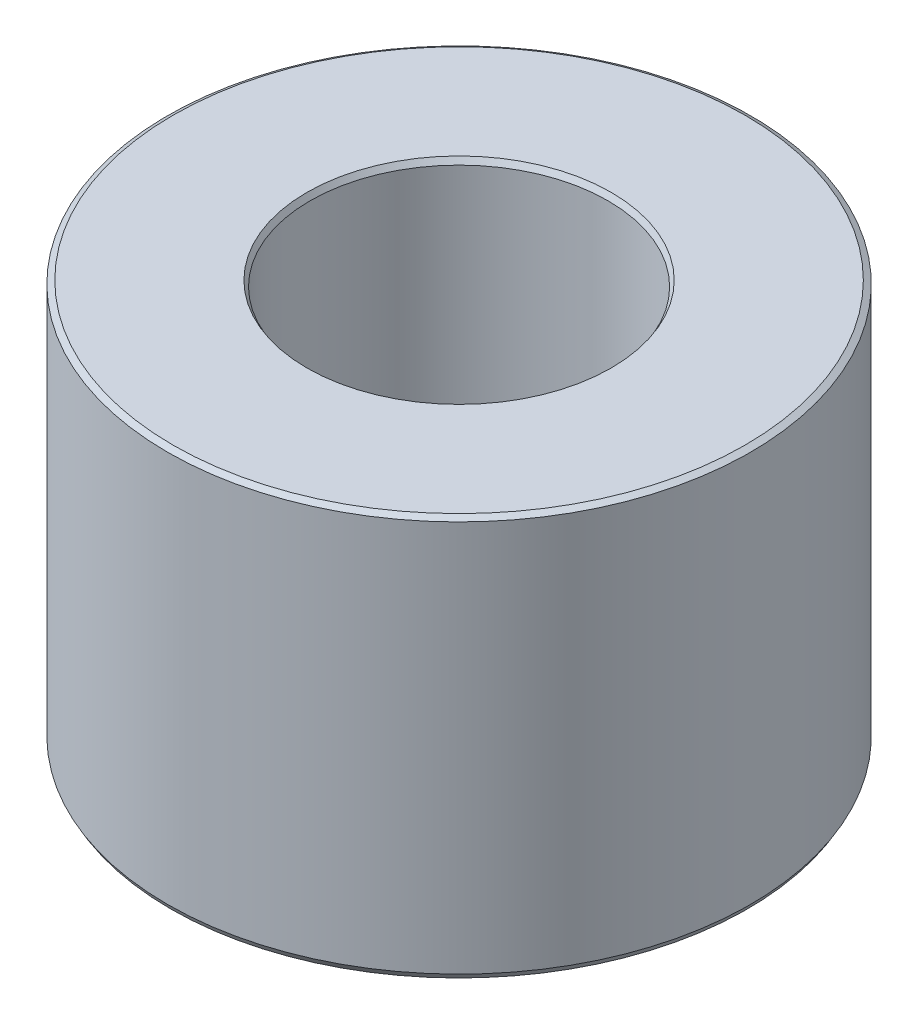
ISO-10303-21;
HEADER;
FILE_DESCRIPTION(('STEP AP214'),'2;1');
FILE_NAME('part.step','',(''),(''),'','','');
FILE_SCHEMA(('AUTOMOTIVE_DESIGN { 1 0 10303 214 1 1 1 1 }'));
ENDSEC;
DATA;
#1=APPLICATION_CONTEXT('core data for automotive mechanical design processes');
#2=APPLICATION_PROTOCOL_DEFINITION('international standard','automotive_design',2000,#1);
#3=PRODUCT_CONTEXT('',#1,'mechanical');
#4=PRODUCT('Part','Part','',(#3));
#5=PRODUCT_RELATED_PRODUCT_CATEGORY('part','',(#4));
#6=PRODUCT_DEFINITION_FORMATION('','',#4);
#7=PRODUCT_DEFINITION_CONTEXT('part definition',#1,'design');
#8=PRODUCT_DEFINITION('design','',#6,#7);
#9=PRODUCT_DEFINITION_SHAPE('','',#8);
#10=(LENGTH_UNIT() NAMED_UNIT(*) SI_UNIT(.MILLI.,.METRE.));
#11=(NAMED_UNIT(*) PLANE_ANGLE_UNIT() SI_UNIT($,.RADIAN.));
#12=(NAMED_UNIT(*) SI_UNIT($,.STERADIAN.) SOLID_ANGLE_UNIT());
#13=UNCERTAINTY_MEASURE_WITH_UNIT(LENGTH_MEASURE(1.E-05),#10,'distance_accuracy_value','');
#14=(GEOMETRIC_REPRESENTATION_CONTEXT(3) GLOBAL_UNCERTAINTY_ASSIGNED_CONTEXT((#13)) GLOBAL_UNIT_ASSIGNED_CONTEXT((#10,
#11,#12)) REPRESENTATION_CONTEXT('',''));
#15=CARTESIAN_POINT('',(0.,0.,0.));
#16=DIRECTION('',(0.,0.,1.));
#17=DIRECTION('',(1.,0.,0.));
#18=AXIS2_PLACEMENT_3D('',#15,#16,#17);
#19=CARTESIAN_POINT('',(0.,65.2626744363393,0.));
#20=DIRECTION('',(0.,-1.,0.));
#21=DIRECTION('',(0.,0.,-1.));
#22=AXIS2_PLACEMENT_3D('',#19,#20,#21);
#23=CYLINDRICAL_SURFACE('',#22,47.5);
#24=CARTESIAN_POINT('',(0.,0.916827320530972,0.));
#25=DIRECTION('',(0.,1.,0.));
#26=DIRECTION('',(0.,0.,1.));
#27=AXIS2_PLACEMENT_3D('',#24,#25,#26);
#28=CIRCLE('',#27,47.5);
#29=CARTESIAN_POINT('',(0.,0.916827320530972,47.5));
#30=VERTEX_POINT('',#29);
#31=EDGE_CURVE('E10',#30,#30,#28,.T.);
#32=ORIENTED_EDGE('',*,*,#31,.T.);
#33=EDGE_LOOP('',(#32));
#34=FACE_BOUND('',#33,.T.);
#35=CARTESIAN_POINT('',(0.,64.7333439360303,0.));
#36=DIRECTION('',(0.,1.,0.));
#37=DIRECTION('',(0.,0.,1.));
#38=AXIS2_PLACEMENT_3D('',#35,#36,#37);
#39=CIRCLE('',#38,47.5);
#40=CARTESIAN_POINT('',(0.,64.7333439360303,47.5));
#41=VERTEX_POINT('',#40);
#42=EDGE_CURVE('E50',#41,#41,#39,.F.);
#43=ORIENTED_EDGE('',*,*,#42,.T.);
#44=EDGE_LOOP('',(#43));
#45=FACE_BOUND('',#44,.T.);
#46=ADVANCED_FACE('F39',(#34,#45),#23,.T.);
#47=CARTESIAN_POINT('',(0.,65.2626744363393,0.));
#48=DIRECTION('',(0.,1.,0.));
#49=DIRECTION('',(0.,0.,1.));
#50=AXIS2_PLACEMENT_3D('',#47,#48,#49);
#51=PLANE('',#50);
#52=CARTESIAN_POINT('',(0.,65.2626744363393,0.));
#53=DIRECTION('',(0.,1.,0.));
#54=DIRECTION('',(0.,0.,1.));
#55=AXIS2_PLACEMENT_3D('',#52,#53,#54);
#56=CIRCLE('',#55,24.792961840033);
#57=CARTESIAN_POINT('',(0.,65.2626744363393,24.792961840033));
#58=VERTEX_POINT('',#57);
#59=EDGE_CURVE('E58',#58,#58,#56,.F.);
#60=ORIENTED_EDGE('',*,*,#59,.T.);
#61=EDGE_LOOP('',(#60));
#62=FACE_BOUND('',#61,.T.);
#63=CARTESIAN_POINT('',(0.,65.2626744363393,0.));
#64=DIRECTION('',(0.,1.,0.));
#65=DIRECTION('',(0.,0.,1.));
#66=AXIS2_PLACEMENT_3D('',#63,#64,#65);
#67=CIRCLE('',#66,46.583172679469);
#68=CARTESIAN_POINT('',(0.,65.2626744363393,46.583172679469));
#69=VERTEX_POINT('',#68);
#70=EDGE_CURVE('E61',#69,#69,#67,.T.);
#71=ORIENTED_EDGE('',*,*,#70,.T.);
#72=EDGE_LOOP('',(#71));
#73=FACE_BOUND('',#72,.T.);
#74=ADVANCED_FACE('F88',(#62,#73),#51,.T.);
#75=CARTESIAN_POINT('',(0.,0.,0.));
#76=DIRECTION('',(0.,1.,0.));
#77=DIRECTION('',(0.,0.,1.));
#78=AXIS2_PLACEMENT_3D('',#75,#76,#77);
#79=PLANE('',#78);
#80=CARTESIAN_POINT('',(0.,0.,0.));
#81=DIRECTION('',(0.,1.,0.));
#82=DIRECTION('',(0.,0.,1.));
#83=AXIS2_PLACEMENT_3D('',#80,#81,#82);
#84=CIRCLE('',#83,25.1804586602549);
#85=CARTESIAN_POINT('',(0.,0.,25.1804586602549));
#86=VERTEX_POINT('',#85);
#87=EDGE_CURVE('E51',#86,#86,#84,.T.);
#88=ORIENTED_EDGE('',*,*,#87,.T.);
#89=EDGE_LOOP('',(#88));
#90=FACE_BOUND('',#89,.T.);
#91=CARTESIAN_POINT('',(0.,0.,0.));
#92=DIRECTION('',(0.,1.,0.));
#93=DIRECTION('',(0.,0.,1.));
#94=AXIS2_PLACEMENT_3D('',#91,#92,#93);
#95=CIRCLE('',#94,46.970669499691);
#96=CARTESIAN_POINT('',(0.,0.,46.970669499691));
#97=VERTEX_POINT('',#96);
#98=EDGE_CURVE('E54',#97,#97,#95,.F.);
#99=ORIENTED_EDGE('',*,*,#98,.T.);
#100=EDGE_LOOP('',(#99));
#101=FACE_BOUND('',#100,.T.);
#102=ADVANCED_FACE('F83',(#90,#101),#79,.F.);
#103=CARTESIAN_POINT('',(0.,65.2626744363393,0.));
#104=DIRECTION('',(0.,-1.,0.));
#105=DIRECTION('',(0.,0.,-1.));
#106=AXIS2_PLACEMENT_3D('',#103,#104,#105);
#107=CYLINDRICAL_SURFACE('',#106,24.263631339724);
#108=CARTESIAN_POINT('',(0.,64.3458471158083,0.));
#109=DIRECTION('',(0.,1.,0.));
#110=DIRECTION('',(0.,0.,1.));
#111=AXIS2_PLACEMENT_3D('',#108,#109,#110);
#112=CIRCLE('',#111,24.263631339724);
#113=CARTESIAN_POINT('',(0.,64.3458471158083,24.263631339724));
#114=VERTEX_POINT('',#113);
#115=EDGE_CURVE('E67',#114,#114,#112,.T.);
#116=ORIENTED_EDGE('',*,*,#115,.T.);
#117=EDGE_LOOP('',(#116));
#118=FACE_BOUND('',#117,.T.);
#119=CARTESIAN_POINT('',(0.,0.529330500308955,0.));
#120=DIRECTION('',(0.,1.,0.));
#121=DIRECTION('',(0.,0.,1.));
#122=AXIS2_PLACEMENT_3D('',#119,#120,#121);
#123=CIRCLE('',#122,24.263631339724);
#124=CARTESIAN_POINT('',(0.,0.529330500308955,24.263631339724));
#125=VERTEX_POINT('',#124);
#126=EDGE_CURVE('E69',#125,#125,#123,.F.);
#127=ORIENTED_EDGE('',*,*,#126,.T.);
#128=EDGE_LOOP('',(#127));
#129=FACE_BOUND('',#128,.T.);
#130=ADVANCED_FACE('F71',(#118,#129),#107,.F.);
#131=CARTESIAN_POINT('',(0.,64.3458471158083,0.));
#132=DIRECTION('',(0.,1.,0.));
#133=DIRECTION('',(0.,0.,1.));
#134=AXIS2_PLACEMENT_3D('',#131,#132,#133);
#135=CONICAL_SURFACE('',#134,24.263631339724,0.523598775598302);
#136=CARTESIAN_POINT('',(0.,65.2626744363393,24.792961840033));
#137=CARTESIAN_POINT('',(0.,65.2531241517504,24.7874479806547));
#138=CARTESIAN_POINT('',(0.,65.2435738671615,24.7819341212765));
#139=CARTESIAN_POINT('',(0.,65.2244732979838,24.7709064025201));
#140=CARTESIAN_POINT('',(0.,65.2149230133949,24.7653925431419));
#141=CARTESIAN_POINT('',(0.,65.1958224442172,24.7543648243854));
#142=CARTESIAN_POINT('',(0.,65.1862721596283,24.7488509650072));
#143=CARTESIAN_POINT('',(0.,65.1671715904506,24.7378232462508));
#144=CARTESIAN_POINT('',(0.,65.1576213058617,24.7323093868726));
#145=CARTESIAN_POINT('',(0.,65.138520736684,24.7212816681161));
#146=CARTESIAN_POINT('',(0.,65.1289704520951,24.7157678087379));
#147=CARTESIAN_POINT('',(0.,65.1098698829174,24.7047400899815));
#148=CARTESIAN_POINT('',(0.,65.1003195983286,24.6992262306032));
#149=CARTESIAN_POINT('',(0.,65.0812190291508,24.6881985118468));
#150=CARTESIAN_POINT('',(0.,65.071668744562,24.6826846524686));
#151=CARTESIAN_POINT('',(0.,65.0525681753842,24.6716569337121));
#152=CARTESIAN_POINT('',(0.,65.0430178907954,24.6661430743339));
#153=CARTESIAN_POINT('',(0.,65.0239173216176,24.6551153555775));
#154=CARTESIAN_POINT('',(0.,65.0143670370288,24.6496014961993));
#155=CARTESIAN_POINT('',(0.,64.995266467851,24.6385737774428));
#156=CARTESIAN_POINT('',(0.,64.9857161832622,24.6330599180646));
#157=CARTESIAN_POINT('',(0.,64.9666156140845,24.6220321993082));
#158=CARTESIAN_POINT('',(0.,64.9570653294956,24.61651833993));
#159=CARTESIAN_POINT('',(0.,64.9379647603179,24.6054906211735));
#160=CARTESIAN_POINT('',(0.,64.928414475729,24.5999767617953));
#161=CARTESIAN_POINT('',(0.,64.9093139065513,24.5889490430389));
#162=CARTESIAN_POINT('',(0.,64.8997636219624,24.5834351836607));
#163=CARTESIAN_POINT('',(0.,64.8806630527847,24.5724074649042));
#164=CARTESIAN_POINT('',(0.,64.8711127681958,24.566893605526));
#165=CARTESIAN_POINT('',(0.,64.8520121990181,24.5558658867696));
#166=CARTESIAN_POINT('',(0.,64.8424619144292,24.5503520273913));
#167=CARTESIAN_POINT('',(0.,64.8233613452515,24.5393243086349));
#168=CARTESIAN_POINT('',(0.,64.8138110606626,24.5338104492567));
#169=CARTESIAN_POINT('',(0.,64.7947104914849,24.5227827305002));
#170=CARTESIAN_POINT('',(0.,64.785160206896,24.517268871122));
#171=CARTESIAN_POINT('',(0.,64.7660596377183,24.5062411523656));
#172=CARTESIAN_POINT('',(0.,64.7565093531294,24.5007272929874));
#173=CARTESIAN_POINT('',(0.,64.7374087839517,24.4896995742309));
#174=CARTESIAN_POINT('',(0.,64.7278584993628,24.4841857148527));
#175=CARTESIAN_POINT('',(0.,64.7087579301851,24.4731579960963));
#176=CARTESIAN_POINT('',(0.,64.6992076455962,24.4676441367181));
#177=CARTESIAN_POINT('',(0.,64.6801070764185,24.4566164179616));
#178=CARTESIAN_POINT('',(0.,64.6705567918297,24.4511025585834));
#179=CARTESIAN_POINT('',(0.,64.6514562226519,24.440074839827));
#180=CARTESIAN_POINT('',(0.,64.6419059380631,24.4345609804488));
#181=CARTESIAN_POINT('',(0.,64.6228053688853,24.4235332616923));
#182=CARTESIAN_POINT('',(0.,64.6132550842965,24.4180194023141));
#183=CARTESIAN_POINT('',(0.,64.5941545151187,24.4069916835577));
#184=CARTESIAN_POINT('',(0.,64.5846042305299,24.4014778241794));
#185=CARTESIAN_POINT('',(0.,64.5655036613521,24.390450105423));
#186=CARTESIAN_POINT('',(0.,64.5559533767633,24.3849362460448));
#187=CARTESIAN_POINT('',(0.,64.5368528075855,24.3739085272883));
#188=CARTESIAN_POINT('',(0.,64.5273025229967,24.3683946679101));
#189=CARTESIAN_POINT('',(0.,64.508201953819,24.3573669491537));
#190=CARTESIAN_POINT('',(0.,64.4986516692301,24.3518530897755));
#191=CARTESIAN_POINT('',(0.,64.4795511000524,24.340825371019));
#192=CARTESIAN_POINT('',(0.,64.4700008154635,24.3353115116408));
#193=CARTESIAN_POINT('',(0.,64.4509002462858,24.3242837928844));
#194=CARTESIAN_POINT('',(0.,64.4413499616969,24.3187699335062));
#195=CARTESIAN_POINT('',(0.,64.4222493925192,24.3077422147497));
#196=CARTESIAN_POINT('',(0.,64.4126991079303,24.3022283553715));
#197=CARTESIAN_POINT('',(0.,64.3935985387526,24.2912006366151));
#198=CARTESIAN_POINT('',(0.,64.3840482541637,24.2856867772369));
#199=CARTESIAN_POINT('',(0.,64.364947684986,24.2746590584804));
#200=CARTESIAN_POINT('',(0.,64.3553974003971,24.2691451991022));
#201=CARTESIAN_POINT('',(0.,64.3458471158083,24.263631339724));
#202=B_SPLINE_CURVE_WITH_KNOTS('',3,(#136,#137,#138,#139,#140,#141,#142,#143,#144,#145,#146,
#147,#148,#149,#150,#151,#152,#153,#154,#155,#156,#157,#158,#159,#160,#161,#162,#163,#164,#165,
#166,#167,#168,#169,#170,#171,#172,#173,#174,#175,#176,#177,#178,#179,#180,#181,#182,#183,#184,
#185,#186,#187,#188,#189,#190,#191,#192,#193,#194,#195,#196,#197,#198,#199,#200,#201),
.UNSPECIFIED.,.F.,.F.,(4,2,2,2,2,2,2,2,2,2,2,2,2,2,2,2,2,2,2,2,2,2,2,2,2,2,2,2,2,2,2,2,4),(0.,
0.0330831562693085,0.0661663125386171,0.0992494688079239,0.132332625077244,0.165415781346553,
0.19849893761586,0.231582093885168,0.264665250154489,0.297748406423797,0.330831562693104,
0.363914718962413,0.396997875231733,0.43008103150104,0.463164187770349,0.496247344039657,
0.529330500308978,0.562413656578284,0.595496812847593,0.628579969116902,0.661663125386222,
0.694746281655529,0.727829437924837,0.760912594194146,0.793995750463465,0.827078906732773,
0.860162063002082,0.89324521927139,0.926328375540709,0.959411531810018,0.992494688079326,
1.02557784434863,1.05866100061794),.UNSPECIFIED.);
#203=EDGE_CURVE('BSEAM77',#58,#114,#202,.T.);
#204=ORIENTED_EDGE('',*,*,#59,.F.);
#205=ORIENTED_EDGE('',*,*,#115,.F.);
#206=ORIENTED_EDGE('',*,*,#203,.T.);
#207=ORIENTED_EDGE('',*,*,#203,.F.);
#208=EDGE_LOOP('',(#204,#206,#205,#207));
#209=FACE_BOUND('',#208,.T.);
#210=ADVANCED_FACE('F77',(#209),#135,.F.);
#211=CARTESIAN_POINT('',(0.,0.,0.));
#212=DIRECTION('',(0.,-1.,0.));
#213=DIRECTION('',(0.,0.,-1.));
#214=AXIS2_PLACEMENT_3D('',#211,#212,#213);
#215=CONICAL_SURFACE('',#214,25.1804586602549,1.04719755119659);
#216=ORIENTED_EDGE('',*,*,#126,.F.);
#217=EDGE_LOOP('',(#216));
#218=FACE_BOUND('',#217,.T.);
#219=ORIENTED_EDGE('',*,*,#87,.F.);
#220=EDGE_LOOP('',(#219));
#221=FACE_BOUND('',#220,.T.);
#222=ADVANCED_FACE('F73',(#218,#221),#215,.F.);
#223=CARTESIAN_POINT('',(0.,0.916827320530972,0.));
#224=DIRECTION('',(0.,1.,0.));
#225=DIRECTION('',(0.,0.,1.));
#226=AXIS2_PLACEMENT_3D('',#223,#224,#225);
#227=CONICAL_SURFACE('',#226,47.5,0.523598775598307);
#228=ORIENTED_EDGE('',*,*,#98,.F.);
#229=EDGE_LOOP('',(#228));
#230=FACE_BOUND('',#229,.T.);
#231=ORIENTED_EDGE('',*,*,#31,.F.);
#232=EDGE_LOOP('',(#231));
#233=FACE_BOUND('',#232,.T.);
#234=ADVANCED_FACE('F76',(#230,#233),#227,.T.);
#235=CARTESIAN_POINT('',(0.,65.2626744363393,0.));
#236=DIRECTION('',(0.,-1.,0.));
#237=DIRECTION('',(0.,0.,-1.));
#238=AXIS2_PLACEMENT_3D('',#235,#236,#237);
#239=CONICAL_SURFACE('',#238,46.583172679469,1.0471975511966);
#240=ORIENTED_EDGE('',*,*,#42,.F.);
#241=EDGE_LOOP('',(#240));
#242=FACE_BOUND('',#241,.T.);
#243=ORIENTED_EDGE('',*,*,#70,.F.);
#244=EDGE_LOOP('',(#243));
#245=FACE_BOUND('',#244,.T.);
#246=ADVANCED_FACE('F45',(#242,#245),#239,.T.);
#247=CLOSED_SHELL('',(#46,#74,#102,#130,#210,#222,#234,#246));
#248=MANIFOLD_SOLID_BREP('B2',#247);
#249=ADVANCED_BREP_SHAPE_REPRESENTATION('',(#18,#248),#14);
#250=SHAPE_DEFINITION_REPRESENTATION(#9,#249);
ENDSEC;
END-ISO-10303-21;
